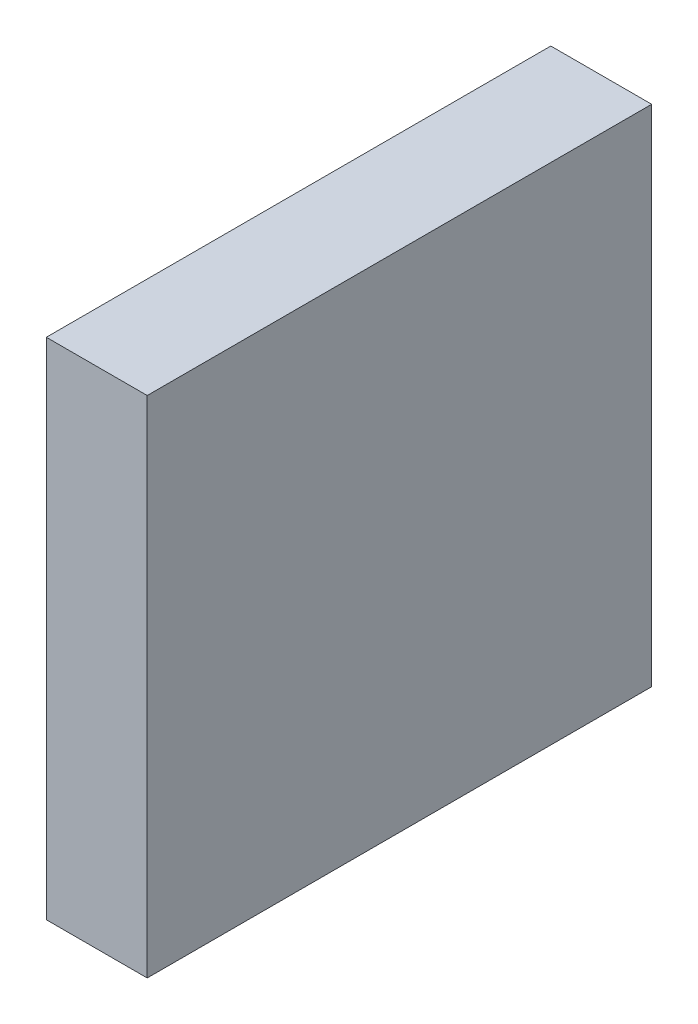
ISO-10303-21;
HEADER;
FILE_DESCRIPTION(('STEP AP214'),'2;1');
FILE_NAME('part.step','',(''),(''),'','','');
FILE_SCHEMA(('AUTOMOTIVE_DESIGN { 1 0 10303 214 1 1 1 1 }'));
ENDSEC;
DATA;
#1=APPLICATION_CONTEXT('core data for automotive mechanical design processes');
#2=APPLICATION_PROTOCOL_DEFINITION('international standard','automotive_design',2000,#1);
#3=PRODUCT_CONTEXT('',#1,'mechanical');
#4=PRODUCT('Part','Part','',(#3));
#5=PRODUCT_RELATED_PRODUCT_CATEGORY('part','',(#4));
#6=PRODUCT_DEFINITION_FORMATION('','',#4);
#7=PRODUCT_DEFINITION_CONTEXT('part definition',#1,'design');
#8=PRODUCT_DEFINITION('design','',#6,#7);
#9=PRODUCT_DEFINITION_SHAPE('','',#8);
#10=(LENGTH_UNIT() NAMED_UNIT(*) SI_UNIT(.MILLI.,.METRE.));
#11=(NAMED_UNIT(*) PLANE_ANGLE_UNIT() SI_UNIT($,.RADIAN.));
#12=(NAMED_UNIT(*) SI_UNIT($,.STERADIAN.) SOLID_ANGLE_UNIT());
#13=UNCERTAINTY_MEASURE_WITH_UNIT(LENGTH_MEASURE(1.E-05),#10,'distance_accuracy_value','');
#14=(GEOMETRIC_REPRESENTATION_CONTEXT(3) GLOBAL_UNCERTAINTY_ASSIGNED_CONTEXT((#13)) GLOBAL_UNIT_ASSIGNED_CONTEXT((#10,
#11,#12)) REPRESENTATION_CONTEXT('',''));
#15=CARTESIAN_POINT('',(0.,0.,0.));
#16=DIRECTION('',(0.,0.,1.));
#17=DIRECTION('',(1.,0.,0.));
#18=AXIS2_PLACEMENT_3D('',#15,#16,#17);
#19=CARTESIAN_POINT('',(0.05000244,0.2499995,0.));
#20=DIRECTION('',(1.,0.,0.));
#21=DIRECTION('',(0.,0.,-1.));
#22=AXIS2_PLACEMENT_3D('',#19,#20,#21);
#23=PLANE('',#22);
#24=DIRECTION('',(0.,0.,-1.));
#25=VECTOR('',#24,1.);
#26=CARTESIAN_POINT('',(0.05000244,-0.2499995,0.));
#27=LINE('',#26,#25);
#28=CARTESIAN_POINT('',(0.05000244,-0.2499995,0.));
#29=VERTEX_POINT('',#28);
#30=CARTESIAN_POINT('',(0.05000244,-0.2499995,0.499999));
#31=VERTEX_POINT('',#30);
#32=EDGE_CURVE('E20',#29,#31,#27,.F.);
#33=ORIENTED_EDGE('',*,*,#32,.F.);
#34=DIRECTION('',(0.,1.,0.));
#35=VECTOR('',#34,1.);
#36=CARTESIAN_POINT('',(0.05000244,-0.2499995,0.));
#37=LINE('',#36,#35);
#38=CARTESIAN_POINT('',(0.05000244,0.2499995,0.));
#39=VERTEX_POINT('',#38);
#40=EDGE_CURVE('E79',#29,#39,#37,.T.);
#41=ORIENTED_EDGE('',*,*,#40,.T.);
#42=DIRECTION('',(0.,0.,1.));
#43=VECTOR('',#42,1.);
#44=CARTESIAN_POINT('',(0.05000244,0.2499995,0.));
#45=LINE('',#44,#43);
#46=CARTESIAN_POINT('',(0.05000244,0.2499995,0.499999));
#47=VERTEX_POINT('',#46);
#48=EDGE_CURVE('E61',#47,#39,#45,.F.);
#49=ORIENTED_EDGE('',*,*,#48,.F.);
#50=DIRECTION('',(0.,1.,0.));
#51=VECTOR('',#50,1.);
#52=CARTESIAN_POINT('',(0.05000244,-0.2499995,0.499999));
#53=LINE('',#52,#51);
#54=EDGE_CURVE('E56',#31,#47,#53,.T.);
#55=ORIENTED_EDGE('',*,*,#54,.F.);
#56=EDGE_LOOP('',(#33,#41,#49,#55));
#57=FACE_BOUND('',#56,.T.);
#58=ADVANCED_FACE('F17',(#57),#23,.T.);
#59=CARTESIAN_POINT('',(0.05000244,-0.2499995,0.));
#60=DIRECTION('',(0.,-1.,0.));
#61=DIRECTION('',(0.,0.,-1.));
#62=AXIS2_PLACEMENT_3D('',#59,#60,#61);
#63=PLANE('',#62);
#64=DIRECTION('',(0.,0.,1.));
#65=VECTOR('',#64,1.);
#66=CARTESIAN_POINT('',(-0.04999989999999,-0.2499995,0.));
#67=LINE('',#66,#65);
#68=CARTESIAN_POINT('',(-0.04999989999999,-0.2499995,0.));
#69=VERTEX_POINT('',#68);
#70=CARTESIAN_POINT('',(-0.04999989999999,-0.2499995,0.499999));
#71=VERTEX_POINT('',#70);
#72=EDGE_CURVE('E83',#69,#71,#67,.T.);
#73=ORIENTED_EDGE('',*,*,#72,.F.);
#74=DIRECTION('',(1.,0.,0.));
#75=VECTOR('',#74,1.);
#76=CARTESIAN_POINT('',(0.05000244,-0.2499995,0.));
#77=LINE('',#76,#75);
#78=EDGE_CURVE('E68',#69,#29,#77,.T.);
#79=ORIENTED_EDGE('',*,*,#78,.T.);
#80=ORIENTED_EDGE('',*,*,#32,.T.);
#81=DIRECTION('',(1.,0.,0.));
#82=VECTOR('',#81,1.);
#83=CARTESIAN_POINT('',(0.05000244,-0.2499995,0.499999));
#84=LINE('',#83,#82);
#85=EDGE_CURVE('E63',#71,#31,#84,.T.);
#86=ORIENTED_EDGE('',*,*,#85,.F.);
#87=EDGE_LOOP('',(#73,#79,#80,#86));
#88=FACE_BOUND('',#87,.T.);
#89=ADVANCED_FACE('F65',(#88),#63,.T.);
#90=CARTESIAN_POINT('',(0.05000244,-0.2499995,0.499999));
#91=DIRECTION('',(0.,0.,1.));
#92=DIRECTION('',(1.,0.,0.));
#93=AXIS2_PLACEMENT_3D('',#90,#91,#92);
#94=PLANE('',#93);
#95=DIRECTION('',(0.,1.,0.));
#96=VECTOR('',#95,1.);
#97=CARTESIAN_POINT('',(-0.04999989999999,-0.2499995,0.499999));
#98=LINE('',#97,#96);
#99=CARTESIAN_POINT('',(-0.04999989999999,0.2499995,0.499999));
#100=VERTEX_POINT('',#99);
#101=EDGE_CURVE('E72',#71,#100,#98,.T.);
#102=ORIENTED_EDGE('',*,*,#101,.F.);
#103=ORIENTED_EDGE('',*,*,#85,.T.);
#104=ORIENTED_EDGE('',*,*,#54,.T.);
#105=DIRECTION('',(1.,0.,0.));
#106=VECTOR('',#105,1.);
#107=CARTESIAN_POINT('',(-0.04999989999999,0.2499995,0.499999));
#108=LINE('',#107,#106);
#109=EDGE_CURVE('E74',#100,#47,#108,.T.);
#110=ORIENTED_EDGE('',*,*,#109,.F.);
#111=EDGE_LOOP('',(#102,#103,#104,#110));
#112=FACE_BOUND('',#111,.T.);
#113=ADVANCED_FACE('F70',(#112),#94,.T.);
#114=CARTESIAN_POINT('',(-0.04999989999999,0.2499995,0.));
#115=DIRECTION('',(0.,1.,0.));
#116=DIRECTION('',(0.,0.,1.));
#117=AXIS2_PLACEMENT_3D('',#114,#115,#116);
#118=PLANE('',#117);
#119=ORIENTED_EDGE('',*,*,#48,.T.);
#120=DIRECTION('',(1.,0.,0.));
#121=VECTOR('',#120,1.);
#122=CARTESIAN_POINT('',(0.05000244,0.2499995,0.));
#123=LINE('',#122,#121);
#124=CARTESIAN_POINT('',(-0.04999989999999,0.2499995,0.));
#125=VERTEX_POINT('',#124);
#126=EDGE_CURVE('E35',#39,#125,#123,.F.);
#127=ORIENTED_EDGE('',*,*,#126,.T.);
#128=DIRECTION('',(0.,0.,1.));
#129=VECTOR('',#128,1.);
#130=CARTESIAN_POINT('',(-0.04999989999999,0.2499995,0.));
#131=LINE('',#130,#129);
#132=EDGE_CURVE('E26',#100,#125,#131,.F.);
#133=ORIENTED_EDGE('',*,*,#132,.F.);
#134=ORIENTED_EDGE('',*,*,#109,.T.);
#135=EDGE_LOOP('',(#119,#127,#133,#134));
#136=FACE_BOUND('',#135,.T.);
#137=ADVANCED_FACE('F89',(#136),#118,.T.);
#138=CARTESIAN_POINT('',(0.05000244,-0.2499995,0.));
#139=DIRECTION('',(0.,0.,1.));
#140=DIRECTION('',(1.,0.,0.));
#141=AXIS2_PLACEMENT_3D('',#138,#139,#140);
#142=PLANE('',#141);
#143=DIRECTION('',(0.,1.,0.));
#144=VECTOR('',#143,1.);
#145=CARTESIAN_POINT('',(-0.04999989999999,-0.2499995,0.));
#146=LINE('',#145,#144);
#147=EDGE_CURVE('E11',#125,#69,#146,.F.);
#148=ORIENTED_EDGE('',*,*,#147,.F.);
#149=ORIENTED_EDGE('',*,*,#126,.F.);
#150=ORIENTED_EDGE('',*,*,#40,.F.);
#151=ORIENTED_EDGE('',*,*,#78,.F.);
#152=EDGE_LOOP('',(#148,#149,#150,#151));
#153=FACE_BOUND('',#152,.T.);
#154=ADVANCED_FACE('F91',(#153),#142,.F.);
#155=CARTESIAN_POINT('',(-0.04999989999999,-0.2499995,0.));
#156=DIRECTION('',(-1.,0.,0.));
#157=DIRECTION('',(0.,0.,1.));
#158=AXIS2_PLACEMENT_3D('',#155,#156,#157);
#159=PLANE('',#158);
#160=ORIENTED_EDGE('',*,*,#132,.T.);
#161=ORIENTED_EDGE('',*,*,#147,.T.);
#162=ORIENTED_EDGE('',*,*,#72,.T.);
#163=ORIENTED_EDGE('',*,*,#101,.T.);
#164=EDGE_LOOP('',(#160,#161,#162,#163));
#165=FACE_BOUND('',#164,.T.);
#166=ADVANCED_FACE('F88',(#165),#159,.T.);
#167=CLOSED_SHELL('',(#58,#89,#113,#137,#154,#166));
#168=MANIFOLD_SOLID_BREP('B1',#167);
#169=ADVANCED_BREP_SHAPE_REPRESENTATION('',(#18,#168),#14);
#170=SHAPE_DEFINITION_REPRESENTATION(#9,#169);
ENDSEC;
END-ISO-10303-21;
